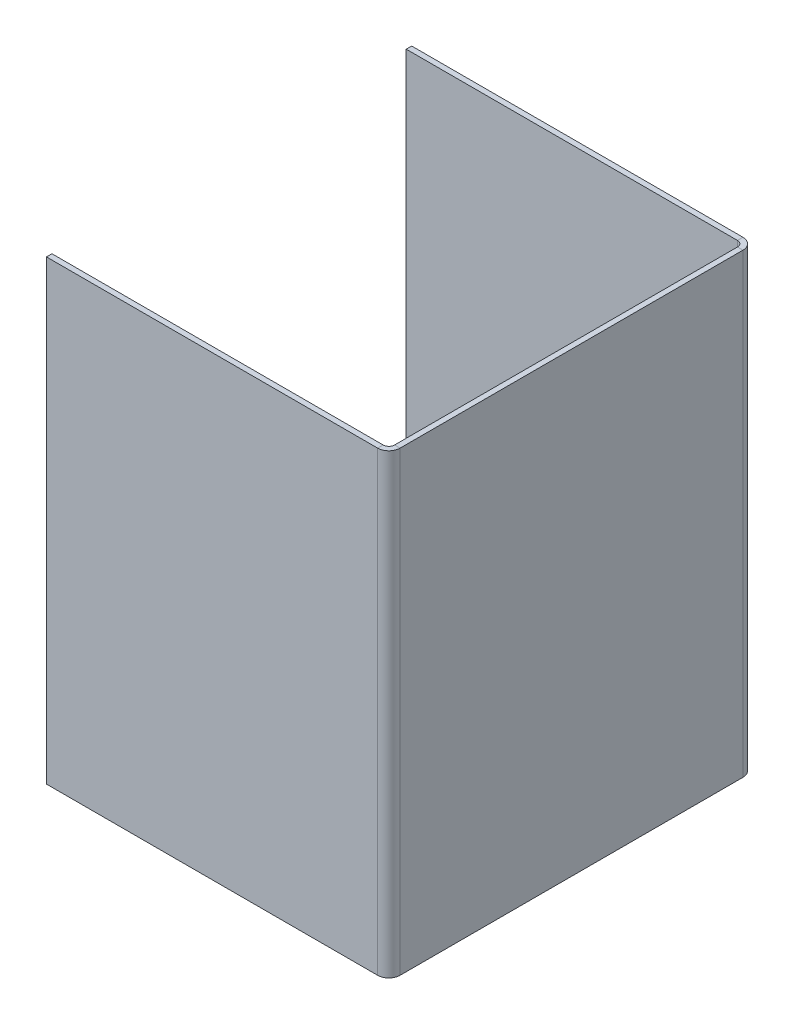
ISO-10303-21;
HEADER;
FILE_DESCRIPTION(('STEP AP214'),'2;1');
FILE_NAME('part.step','',(''),(''),'','','');
FILE_SCHEMA(('AUTOMOTIVE_DESIGN { 1 0 10303 214 1 1 1 1 }'));
ENDSEC;
DATA;
#1=APPLICATION_CONTEXT('core data for automotive mechanical design processes');
#2=APPLICATION_PROTOCOL_DEFINITION('international standard','automotive_design',2000,#1);
#3=PRODUCT_CONTEXT('',#1,'mechanical');
#4=PRODUCT('Part','Part','',(#3));
#5=PRODUCT_RELATED_PRODUCT_CATEGORY('part','',(#4));
#6=PRODUCT_DEFINITION_FORMATION('','',#4);
#7=PRODUCT_DEFINITION_CONTEXT('part definition',#1,'design');
#8=PRODUCT_DEFINITION('design','',#6,#7);
#9=PRODUCT_DEFINITION_SHAPE('','',#8);
#10=(LENGTH_UNIT() NAMED_UNIT(*) SI_UNIT(.MILLI.,.METRE.));
#11=(NAMED_UNIT(*) PLANE_ANGLE_UNIT() SI_UNIT($,.RADIAN.));
#12=(NAMED_UNIT(*) SI_UNIT($,.STERADIAN.) SOLID_ANGLE_UNIT());
#13=UNCERTAINTY_MEASURE_WITH_UNIT(LENGTH_MEASURE(1.E-05),#10,'distance_accuracy_value','');
#14=(GEOMETRIC_REPRESENTATION_CONTEXT(3) GLOBAL_UNCERTAINTY_ASSIGNED_CONTEXT((#13)) GLOBAL_UNIT_ASSIGNED_CONTEXT((#10,
#11,#12)) REPRESENTATION_CONTEXT('',''));
#15=CARTESIAN_POINT('',(0.,0.,0.));
#16=DIRECTION('',(0.,0.,1.));
#17=DIRECTION('',(1.,0.,0.));
#18=AXIS2_PLACEMENT_3D('',#15,#16,#17);
#19=CARTESIAN_POINT('',(-1.2192,0.,0.));
#20=DIRECTION('',(-1.,0.,0.));
#21=DIRECTION('',(0.,0.,1.));
#22=AXIS2_PLACEMENT_3D('',#19,#20,#21);
#23=PLANE('',#22);
#24=DIRECTION('',(0.,0.,1.));
#25=VECTOR('',#24,1.);
#26=CARTESIAN_POINT('',(-1.2192,101.6,0.));
#27=LINE('',#26,#25);
#28=CARTESIAN_POINT('',(-1.2192,101.6,-78.7908));
#29=VERTEX_POINT('',#28);
#30=CARTESIAN_POINT('',(-1.2192,101.6,-2.4892));
#31=VERTEX_POINT('',#30);
#32=EDGE_CURVE('E13',#29,#31,#27,.T.);
#33=ORIENTED_EDGE('',*,*,#32,.F.);
#34=DIRECTION('',(0.,-1.,0.));
#35=VECTOR('',#34,1.);
#36=CARTESIAN_POINT('',(-1.2192,0.,-78.7908));
#37=LINE('',#36,#35);
#38=CARTESIAN_POINT('',(-1.2192,0.,-78.7908));
#39=VERTEX_POINT('',#38);
#40=EDGE_CURVE('E224',#39,#29,#37,.F.);
#41=ORIENTED_EDGE('',*,*,#40,.F.);
#42=DIRECTION('',(0.,0.,-1.));
#43=VECTOR('',#42,1.);
#44=CARTESIAN_POINT('',(-1.2192,0.,0.));
#45=LINE('',#44,#43);
#46=CARTESIAN_POINT('',(-1.2192,0.,-2.4892));
#47=VERTEX_POINT('',#46);
#48=EDGE_CURVE('E87',#47,#39,#45,.T.);
#49=ORIENTED_EDGE('',*,*,#48,.F.);
#50=DIRECTION('',(0.,1.,0.));
#51=VECTOR('',#50,1.);
#52=CARTESIAN_POINT('',(-1.2192,101.6,-2.4892));
#53=LINE('',#52,#51);
#54=EDGE_CURVE('E280',#31,#47,#53,.F.);
#55=ORIENTED_EDGE('',*,*,#54,.F.);
#56=EDGE_LOOP('',(#33,#41,#49,#55));
#57=FACE_BOUND('',#56,.T.);
#58=ADVANCED_FACE('F78',(#57),#23,.T.);
#59=CARTESIAN_POINT('',(0.,0.,0.));
#60=DIRECTION('',(-1.,0.,0.));
#61=DIRECTION('',(0.,0.,1.));
#62=AXIS2_PLACEMENT_3D('',#59,#60,#61);
#63=PLANE('',#62);
#64=DIRECTION('',(0.,-1.,0.));
#65=VECTOR('',#64,1.);
#66=CARTESIAN_POINT('',(0.,0.,-78.7908));
#67=LINE('',#66,#65);
#68=CARTESIAN_POINT('',(0.,0.,-78.7908));
#69=VERTEX_POINT('',#68);
#70=CARTESIAN_POINT('',(0.,101.6,-78.7908));
#71=VERTEX_POINT('',#70);
#72=EDGE_CURVE('E212',#69,#71,#67,.F.);
#73=ORIENTED_EDGE('',*,*,#72,.T.);
#74=DIRECTION('',(0.,0.,1.));
#75=VECTOR('',#74,1.);
#76=CARTESIAN_POINT('',(0.,101.6,0.));
#77=LINE('',#76,#75);
#78=CARTESIAN_POINT('',(0.,101.6,-2.4892));
#79=VERTEX_POINT('',#78);
#80=EDGE_CURVE('E82',#71,#79,#77,.T.);
#81=ORIENTED_EDGE('',*,*,#80,.T.);
#82=DIRECTION('',(0.,1.,0.));
#83=VECTOR('',#82,1.);
#84=CARTESIAN_POINT('',(0.,101.6,-2.4892));
#85=LINE('',#84,#83);
#86=CARTESIAN_POINT('',(0.,0.,-2.4892));
#87=VERTEX_POINT('',#86);
#88=EDGE_CURVE('E268',#79,#87,#85,.F.);
#89=ORIENTED_EDGE('',*,*,#88,.T.);
#90=DIRECTION('',(0.,0.,-1.));
#91=VECTOR('',#90,1.);
#92=CARTESIAN_POINT('',(0.,0.,0.));
#93=LINE('',#92,#91);
#94=EDGE_CURVE('E286',#87,#69,#93,.T.);
#95=ORIENTED_EDGE('',*,*,#94,.T.);
#96=EDGE_LOOP('',(#73,#81,#89,#95));
#97=FACE_BOUND('',#96,.T.);
#98=ADVANCED_FACE('F290',(#97),#63,.F.);
#99=CARTESIAN_POINT('',(-1.2192,0.,0.));
#100=DIRECTION('',(0.,-1.,0.));
#101=DIRECTION('',(0.,0.,-1.));
#102=AXIS2_PLACEMENT_3D('',#99,#100,#101);
#103=PLANE('',#102);
#104=ORIENTED_EDGE('',*,*,#48,.T.);
#105=DIRECTION('',(1.,0.,0.));
#106=VECTOR('',#105,1.);
#107=CARTESIAN_POINT('',(-1.2192,0.,-78.7908));
#108=LINE('',#107,#106);
#109=EDGE_CURVE('E218',#39,#69,#108,.T.);
#110=ORIENTED_EDGE('',*,*,#109,.T.);
#111=ORIENTED_EDGE('',*,*,#94,.F.);
#112=DIRECTION('',(1.,0.,0.));
#113=VECTOR('',#112,1.);
#114=CARTESIAN_POINT('',(-1.2192,0.,-2.4892));
#115=LINE('',#114,#113);
#116=EDGE_CURVE('E95',#47,#87,#115,.T.);
#117=ORIENTED_EDGE('',*,*,#116,.F.);
#118=EDGE_LOOP('',(#104,#110,#111,#117));
#119=FACE_BOUND('',#118,.T.);
#120=ADVANCED_FACE('F80',(#119),#103,.T.);
#121=CARTESIAN_POINT('',(-1.2192,101.6,0.));
#122=DIRECTION('',(0.,1.,0.));
#123=DIRECTION('',(0.,0.,1.));
#124=AXIS2_PLACEMENT_3D('',#121,#122,#123);
#125=PLANE('',#124);
#126=DIRECTION('',(1.,0.,0.));
#127=VECTOR('',#126,1.);
#128=CARTESIAN_POINT('',(-1.2192,101.6,-78.7908));
#129=LINE('',#128,#127);
#130=EDGE_CURVE('E230',#29,#71,#129,.T.);
#131=ORIENTED_EDGE('',*,*,#130,.F.);
#132=ORIENTED_EDGE('',*,*,#32,.T.);
#133=DIRECTION('',(1.,0.,0.));
#134=VECTOR('',#133,1.);
#135=CARTESIAN_POINT('',(-1.2192,101.6,-2.4892));
#136=LINE('',#135,#134);
#137=EDGE_CURVE('E274',#31,#79,#136,.T.);
#138=ORIENTED_EDGE('',*,*,#137,.T.);
#139=ORIENTED_EDGE('',*,*,#80,.F.);
#140=EDGE_LOOP('',(#131,#132,#138,#139));
#141=FACE_BOUND('',#140,.T.);
#142=ADVANCED_FACE('F294',(#141),#125,.T.);
#143=CARTESIAN_POINT('',(-2.4892,0.,-2.4892));
#144=DIRECTION('',(0.,-1.,0.));
#145=DIRECTION('',(0.,0.,-1.));
#146=AXIS2_PLACEMENT_3D('',#143,#144,#145);
#147=PLANE('',#146);
#148=DIRECTION('',(0.,0.,1.));
#149=VECTOR('',#148,1.);
#150=CARTESIAN_POINT('',(-2.4892,0.,2.61726404438001E-13));
#151=LINE('',#150,#149);
#152=CARTESIAN_POINT('',(-2.48919999999999,0.,-1.2192));
#153=VERTEX_POINT('',#152);
#154=CARTESIAN_POINT('',(-2.48919999999999,0.,0.));
#155=VERTEX_POINT('',#154);
#156=EDGE_CURVE('E233',#153,#155,#151,.T.);
#157=ORIENTED_EDGE('',*,*,#156,.F.);
#158=CARTESIAN_POINT('',(-2.4892,0.,-2.4892));
#159=DIRECTION('',(0.,1.,0.));
#160=DIRECTION('',(0.,0.,1.));
#161=AXIS2_PLACEMENT_3D('',#158,#159,#160);
#162=CIRCLE('',#161,1.27);
#163=EDGE_CURVE('E277',#47,#153,#162,.F.);
#164=ORIENTED_EDGE('',*,*,#163,.F.);
#165=ORIENTED_EDGE('',*,*,#116,.T.);
#166=CARTESIAN_POINT('',(-2.4892,0.,-2.4892));
#167=DIRECTION('',(0.,1.,0.));
#168=DIRECTION('',(0.,0.,1.));
#169=AXIS2_PLACEMENT_3D('',#166,#167,#168);
#170=CIRCLE('',#169,2.4892);
#171=EDGE_CURVE('E270',#87,#155,#170,.F.);
#172=ORIENTED_EDGE('',*,*,#171,.T.);
#173=EDGE_LOOP('',(#157,#164,#165,#172));
#174=FACE_BOUND('',#173,.T.);
#175=ADVANCED_FACE('F319',(#174),#147,.T.);
#176=CARTESIAN_POINT('',(-2.4892,101.6,-2.4892));
#177=DIRECTION('',(0.,-1.,0.));
#178=DIRECTION('',(0.,0.,-1.));
#179=AXIS2_PLACEMENT_3D('',#176,#177,#178);
#180=PLANE('',#179);
#181=CARTESIAN_POINT('',(-2.4892,101.6,-2.4892));
#182=DIRECTION('',(0.,1.,0.));
#183=DIRECTION('',(0.,0.,1.));
#184=AXIS2_PLACEMENT_3D('',#181,#182,#183);
#185=CIRCLE('',#184,1.27);
#186=CARTESIAN_POINT('',(-2.48919999999999,101.6,-1.2192));
#187=VERTEX_POINT('',#186);
#188=EDGE_CURVE('E238',#187,#31,#185,.T.);
#189=ORIENTED_EDGE('',*,*,#188,.F.);
#190=DIRECTION('',(0.,0.,1.));
#191=VECTOR('',#190,1.);
#192=CARTESIAN_POINT('',(-2.4892,101.6,-1.2192));
#193=LINE('',#192,#191);
#194=CARTESIAN_POINT('',(-2.4892,101.6,0.));
#195=VERTEX_POINT('',#194);
#196=EDGE_CURVE('E261',#187,#195,#193,.T.);
#197=ORIENTED_EDGE('',*,*,#196,.T.);
#198=CARTESIAN_POINT('',(-2.4892,101.6,-2.4892));
#199=DIRECTION('',(0.,1.,0.));
#200=DIRECTION('',(0.,0.,1.));
#201=AXIS2_PLACEMENT_3D('',#198,#199,#200);
#202=CIRCLE('',#201,2.4892);
#203=EDGE_CURVE('E271',#195,#79,#202,.T.);
#204=ORIENTED_EDGE('',*,*,#203,.T.);
#205=ORIENTED_EDGE('',*,*,#137,.F.);
#206=EDGE_LOOP('',(#189,#197,#204,#205));
#207=FACE_BOUND('',#206,.T.);
#208=ADVANCED_FACE('F300',(#207),#180,.F.);
#209=CARTESIAN_POINT('',(-2.4892,101.6,-2.4892));
#210=DIRECTION('',(0.,1.,0.));
#211=DIRECTION('',(0.,0.,1.));
#212=AXIS2_PLACEMENT_3D('',#209,#210,#211);
#213=CYLINDRICAL_SURFACE('',#212,2.4892);
#214=ORIENTED_EDGE('',*,*,#88,.F.);
#215=ORIENTED_EDGE('',*,*,#203,.F.);
#216=DIRECTION('',(0.,1.,0.));
#217=VECTOR('',#216,1.);
#218=CARTESIAN_POINT('',(-2.4892,0.,0.));
#219=LINE('',#218,#217);
#220=EDGE_CURVE('E258',#155,#195,#219,.T.);
#221=ORIENTED_EDGE('',*,*,#220,.F.);
#222=ORIENTED_EDGE('',*,*,#171,.F.);
#223=EDGE_LOOP('',(#214,#215,#221,#222));
#224=FACE_BOUND('',#223,.T.);
#225=ADVANCED_FACE('F299',(#224),#213,.T.);
#226=CARTESIAN_POINT('',(-2.4892,101.6,-2.4892));
#227=DIRECTION('',(0.,1.,0.));
#228=DIRECTION('',(0.,0.,1.));
#229=AXIS2_PLACEMENT_3D('',#226,#227,#228);
#230=CYLINDRICAL_SURFACE('',#229,1.27);
#231=ORIENTED_EDGE('',*,*,#54,.T.);
#232=ORIENTED_EDGE('',*,*,#163,.T.);
#233=DIRECTION('',(0.,-1.,0.));
#234=VECTOR('',#233,1.);
#235=CARTESIAN_POINT('',(-2.4892,0.,-1.2192));
#236=LINE('',#235,#234);
#237=EDGE_CURVE('E264',#153,#187,#236,.F.);
#238=ORIENTED_EDGE('',*,*,#237,.T.);
#239=ORIENTED_EDGE('',*,*,#188,.T.);
#240=EDGE_LOOP('',(#231,#232,#238,#239));
#241=FACE_BOUND('',#240,.T.);
#242=ADVANCED_FACE('F322',(#241),#230,.F.);
#243=CARTESIAN_POINT('',(-1.2192,101.6,0.));
#244=DIRECTION('',(0.,1.,0.));
#245=DIRECTION('',(0.,0.,1.));
#246=AXIS2_PLACEMENT_3D('',#243,#244,#245);
#247=PLANE('',#246);
#248=DIRECTION('',(1.,0.,0.));
#249=VECTOR('',#248,1.);
#250=CARTESIAN_POINT('',(-1.2192,101.6,0.));
#251=LINE('',#250,#249);
#252=CARTESIAN_POINT('',(-76.2,101.6,2.61714069329905E-13));
#253=VERTEX_POINT('',#252);
#254=EDGE_CURVE('E242',#253,#195,#251,.T.);
#255=ORIENTED_EDGE('',*,*,#254,.T.);
#256=ORIENTED_EDGE('',*,*,#196,.F.);
#257=DIRECTION('',(-1.,0.,0.));
#258=VECTOR('',#257,1.);
#259=CARTESIAN_POINT('',(0.,101.6,-1.2192));
#260=LINE('',#259,#258);
#261=CARTESIAN_POINT('',(-76.2,101.6,-1.21919999999974));
#262=VERTEX_POINT('',#261);
#263=EDGE_CURVE('E250',#262,#187,#260,.F.);
#264=ORIENTED_EDGE('',*,*,#263,.F.);
#265=DIRECTION('',(0.,0.,-1.));
#266=VECTOR('',#265,1.);
#267=CARTESIAN_POINT('',(-76.2,101.6,2.61726404438001E-13));
#268=LINE('',#267,#266);
#269=EDGE_CURVE('E236',#253,#262,#268,.T.);
#270=ORIENTED_EDGE('',*,*,#269,.F.);
#271=EDGE_LOOP('',(#255,#256,#264,#270));
#272=FACE_BOUND('',#271,.T.);
#273=ADVANCED_FACE('F309',(#272),#247,.T.);
#274=CARTESIAN_POINT('',(-76.2,0.,2.61726404438001E-13));
#275=DIRECTION('',(0.,-1.,0.));
#276=DIRECTION('',(0.,0.,-1.));
#277=AXIS2_PLACEMENT_3D('',#274,#275,#276);
#278=PLANE('',#277);
#279=DIRECTION('',(1.,0.,0.));
#280=VECTOR('',#279,1.);
#281=CARTESIAN_POINT('',(0.,0.,-1.2192));
#282=LINE('',#281,#280);
#283=CARTESIAN_POINT('',(-76.2,0.,-1.21919999999974));
#284=VERTEX_POINT('',#283);
#285=EDGE_CURVE('E256',#153,#284,#282,.F.);
#286=ORIENTED_EDGE('',*,*,#285,.F.);
#287=ORIENTED_EDGE('',*,*,#156,.T.);
#288=DIRECTION('',(-1.,0.,0.));
#289=VECTOR('',#288,1.);
#290=CARTESIAN_POINT('',(-76.2,0.,2.61714069329905E-13));
#291=LINE('',#290,#289);
#292=CARTESIAN_POINT('',(-76.2,0.,2.61714069329905E-13));
#293=VERTEX_POINT('',#292);
#294=EDGE_CURVE('E248',#155,#293,#291,.T.);
#295=ORIENTED_EDGE('',*,*,#294,.T.);
#296=DIRECTION('',(0.,0.,-1.));
#297=VECTOR('',#296,1.);
#298=CARTESIAN_POINT('',(-76.2,0.,2.61726404438001E-13));
#299=LINE('',#298,#297);
#300=EDGE_CURVE('E239',#293,#284,#299,.T.);
#301=ORIENTED_EDGE('',*,*,#300,.T.);
#302=EDGE_LOOP('',(#286,#287,#295,#301));
#303=FACE_BOUND('',#302,.T.);
#304=ADVANCED_FACE('F316',(#303),#278,.T.);
#305=CARTESIAN_POINT('',(0.,0.,0.));
#306=DIRECTION('',(0.,0.,1.));
#307=DIRECTION('',(1.,0.,0.));
#308=AXIS2_PLACEMENT_3D('',#305,#306,#307);
#309=PLANE('',#308);
#310=ORIENTED_EDGE('',*,*,#294,.F.);
#311=ORIENTED_EDGE('',*,*,#220,.T.);
#312=ORIENTED_EDGE('',*,*,#254,.F.);
#313=DIRECTION('',(0.,1.,0.));
#314=VECTOR('',#313,1.);
#315=CARTESIAN_POINT('',(-76.2,101.6,2.61714069329905E-13));
#316=LINE('',#315,#314);
#317=EDGE_CURVE('E245',#293,#253,#316,.T.);
#318=ORIENTED_EDGE('',*,*,#317,.F.);
#319=EDGE_LOOP('',(#310,#311,#312,#318));
#320=FACE_BOUND('',#319,.T.);
#321=ADVANCED_FACE('F307',(#320),#309,.T.);
#322=CARTESIAN_POINT('',(0.,0.,-1.2192));
#323=DIRECTION('',(0.,0.,1.));
#324=DIRECTION('',(1.,0.,0.));
#325=AXIS2_PLACEMENT_3D('',#322,#323,#324);
#326=PLANE('',#325);
#327=ORIENTED_EDGE('',*,*,#237,.F.);
#328=ORIENTED_EDGE('',*,*,#285,.T.);
#329=DIRECTION('',(0.,-1.,0.));
#330=VECTOR('',#329,1.);
#331=CARTESIAN_POINT('',(-76.2,0.,-1.21919999999974));
#332=LINE('',#331,#330);
#333=EDGE_CURVE('E253',#284,#262,#332,.F.);
#334=ORIENTED_EDGE('',*,*,#333,.T.);
#335=ORIENTED_EDGE('',*,*,#263,.T.);
#336=EDGE_LOOP('',(#327,#328,#334,#335));
#337=FACE_BOUND('',#336,.T.);
#338=ADVANCED_FACE('F324',(#337),#326,.F.);
#339=CARTESIAN_POINT('',(-76.2,101.6,2.61726404438001E-13));
#340=DIRECTION('',(-1.,0.,0.));
#341=DIRECTION('',(0.,0.,1.));
#342=AXIS2_PLACEMENT_3D('',#339,#340,#341);
#343=PLANE('',#342);
#344=ORIENTED_EDGE('',*,*,#333,.F.);
#345=ORIENTED_EDGE('',*,*,#300,.F.);
#346=ORIENTED_EDGE('',*,*,#317,.T.);
#347=ORIENTED_EDGE('',*,*,#269,.T.);
#348=EDGE_LOOP('',(#344,#345,#346,#347));
#349=FACE_BOUND('',#348,.T.);
#350=ADVANCED_FACE('F313',(#349),#343,.T.);
#351=CARTESIAN_POINT('',(-2.4892,101.6,-78.7908));
#352=DIRECTION('',(0.,1.,0.));
#353=DIRECTION('',(0.,0.,1.));
#354=AXIS2_PLACEMENT_3D('',#351,#352,#353);
#355=PLANE('',#354);
#356=DIRECTION('',(0.,0.,1.));
#357=VECTOR('',#356,1.);
#358=CARTESIAN_POINT('',(-2.4892,101.6,-81.28));
#359=LINE('',#358,#357);
#360=CARTESIAN_POINT('',(-2.48919999999999,101.6,-80.0608));
#361=VERTEX_POINT('',#360);
#362=CARTESIAN_POINT('',(-2.48919999999999,101.6,-81.28));
#363=VERTEX_POINT('',#362);
#364=EDGE_CURVE('E194',#361,#363,#359,.F.);
#365=ORIENTED_EDGE('',*,*,#364,.F.);
#366=CARTESIAN_POINT('',(-2.4892,101.6,-78.7908));
#367=DIRECTION('',(0.,-1.,0.));
#368=DIRECTION('',(0.,0.,-1.));
#369=AXIS2_PLACEMENT_3D('',#366,#367,#368);
#370=CIRCLE('',#369,1.26999999999999);
#371=EDGE_CURVE('E221',#29,#361,#370,.F.);
#372=ORIENTED_EDGE('',*,*,#371,.F.);
#373=ORIENTED_EDGE('',*,*,#130,.T.);
#374=CARTESIAN_POINT('',(-2.4892,101.6,-78.7908));
#375=DIRECTION('',(0.,-1.,0.));
#376=DIRECTION('',(0.,0.,-1.));
#377=AXIS2_PLACEMENT_3D('',#374,#375,#376);
#378=CIRCLE('',#377,2.48919999999999);
#379=EDGE_CURVE('E214',#71,#363,#378,.F.);
#380=ORIENTED_EDGE('',*,*,#379,.T.);
#381=EDGE_LOOP('',(#365,#372,#373,#380));
#382=FACE_BOUND('',#381,.T.);
#383=ADVANCED_FACE('F331',(#382),#355,.T.);
#384=CARTESIAN_POINT('',(-2.4892,0.,-78.7908));
#385=DIRECTION('',(0.,1.,0.));
#386=DIRECTION('',(0.,0.,1.));
#387=AXIS2_PLACEMENT_3D('',#384,#385,#386);
#388=PLANE('',#387);
#389=CARTESIAN_POINT('',(-2.4892,0.,-78.7908));
#390=DIRECTION('',(0.,-1.,0.));
#391=DIRECTION('',(0.,0.,-1.));
#392=AXIS2_PLACEMENT_3D('',#389,#390,#391);
#393=CIRCLE('',#392,1.26999999999999);
#394=CARTESIAN_POINT('',(-2.48919999999999,0.,-80.0608));
#395=VERTEX_POINT('',#394);
#396=EDGE_CURVE('E227',#395,#39,#393,.T.);
#397=ORIENTED_EDGE('',*,*,#396,.F.);
#398=DIRECTION('',(0.,0.,1.));
#399=VECTOR('',#398,1.);
#400=CARTESIAN_POINT('',(-2.4892,0.,-80.0608));
#401=LINE('',#400,#399);
#402=CARTESIAN_POINT('',(-2.4892,0.,-81.28));
#403=VERTEX_POINT('',#402);
#404=EDGE_CURVE('E206',#395,#403,#401,.F.);
#405=ORIENTED_EDGE('',*,*,#404,.T.);
#406=CARTESIAN_POINT('',(-2.4892,0.,-78.7908));
#407=DIRECTION('',(0.,-1.,0.));
#408=DIRECTION('',(0.,0.,-1.));
#409=AXIS2_PLACEMENT_3D('',#406,#407,#408);
#410=CIRCLE('',#409,2.48919999999999);
#411=EDGE_CURVE('E215',#403,#69,#410,.T.);
#412=ORIENTED_EDGE('',*,*,#411,.T.);
#413=ORIENTED_EDGE('',*,*,#109,.F.);
#414=EDGE_LOOP('',(#397,#405,#412,#413));
#415=FACE_BOUND('',#414,.T.);
#416=ADVANCED_FACE('F354',(#415),#388,.F.);
#417=CARTESIAN_POINT('',(-2.4892,0.,-78.7908));
#418=DIRECTION('',(0.,-1.,0.));
#419=DIRECTION('',(0.,0.,-1.));
#420=AXIS2_PLACEMENT_3D('',#417,#418,#419);
#421=CYLINDRICAL_SURFACE('',#420,2.48919999999999);
#422=ORIENTED_EDGE('',*,*,#72,.F.);
#423=ORIENTED_EDGE('',*,*,#411,.F.);
#424=DIRECTION('',(0.,-1.,0.));
#425=VECTOR('',#424,1.);
#426=CARTESIAN_POINT('',(-2.4892,101.6,-81.28));
#427=LINE('',#426,#425);
#428=EDGE_CURVE('E204',#403,#363,#427,.F.);
#429=ORIENTED_EDGE('',*,*,#428,.T.);
#430=ORIENTED_EDGE('',*,*,#379,.F.);
#431=EDGE_LOOP('',(#422,#423,#429,#430));
#432=FACE_BOUND('',#431,.T.);
#433=ADVANCED_FACE('F367',(#432),#421,.T.);
#434=CARTESIAN_POINT('',(-2.4892,0.,-78.7908));
#435=DIRECTION('',(0.,-1.,0.));
#436=DIRECTION('',(0.,0.,-1.));
#437=AXIS2_PLACEMENT_3D('',#434,#435,#436);
#438=CYLINDRICAL_SURFACE('',#437,1.26999999999999);
#439=ORIENTED_EDGE('',*,*,#40,.T.);
#440=ORIENTED_EDGE('',*,*,#371,.T.);
#441=DIRECTION('',(0.,-1.,0.));
#442=VECTOR('',#441,1.);
#443=CARTESIAN_POINT('',(-2.4892,101.6,-80.0608));
#444=LINE('',#443,#442);
#445=EDGE_CURVE('E209',#361,#395,#444,.T.);
#446=ORIENTED_EDGE('',*,*,#445,.T.);
#447=ORIENTED_EDGE('',*,*,#396,.T.);
#448=EDGE_LOOP('',(#439,#440,#446,#447));
#449=FACE_BOUND('',#448,.T.);
#450=ADVANCED_FACE('F357',(#449),#438,.F.);
#451=CARTESIAN_POINT('',(-76.2,0.,-81.2800000000003));
#452=DIRECTION('',(0.,1.,0.));
#453=DIRECTION('',(0.,0.,1.));
#454=AXIS2_PLACEMENT_3D('',#451,#452,#453);
#455=PLANE('',#454);
#456=ORIENTED_EDGE('',*,*,#404,.F.);
#457=DIRECTION('',(1.,0.,0.));
#458=VECTOR('',#457,1.);
#459=CARTESIAN_POINT('',(-76.2,0.,-80.0608000000003));
#460=LINE('',#459,#458);
#461=CARTESIAN_POINT('',(-76.2,0.,-80.0608000000003));
#462=VERTEX_POINT('',#461);
#463=EDGE_CURVE('E202',#395,#462,#460,.F.);
#464=ORIENTED_EDGE('',*,*,#463,.T.);
#465=DIRECTION('',(0.,0.,1.));
#466=VECTOR('',#465,1.);
#467=CARTESIAN_POINT('',(-76.2,0.,-81.2800000000003));
#468=LINE('',#467,#466);
#469=CARTESIAN_POINT('',(-76.2,0.,-81.2800000000003));
#470=VERTEX_POINT('',#469);
#471=EDGE_CURVE('E190',#470,#462,#468,.T.);
#472=ORIENTED_EDGE('',*,*,#471,.F.);
#473=DIRECTION('',(-1.,0.,0.));
#474=VECTOR('',#473,1.);
#475=CARTESIAN_POINT('',(2.90086590035824E-13,0.,-81.28));
#476=LINE('',#475,#474);
#477=EDGE_CURVE('E177',#403,#470,#476,.T.);
#478=ORIENTED_EDGE('',*,*,#477,.F.);
#479=EDGE_LOOP('',(#456,#464,#472,#478));
#480=FACE_BOUND('',#479,.T.);
#481=ADVANCED_FACE('F364',(#480),#455,.F.);
#482=CARTESIAN_POINT('',(-1.2192,101.6,-81.28));
#483=DIRECTION('',(0.,-1.,0.));
#484=DIRECTION('',(0.,0.,-1.));
#485=AXIS2_PLACEMENT_3D('',#482,#483,#484);
#486=PLANE('',#485);
#487=ORIENTED_EDGE('',*,*,#364,.T.);
#488=DIRECTION('',(1.,0.,0.));
#489=VECTOR('',#488,1.);
#490=CARTESIAN_POINT('',(2.90086590035824E-13,101.6,-81.28));
#491=LINE('',#490,#489);
#492=CARTESIAN_POINT('',(-76.2,101.6,-81.2800000000003));
#493=VERTEX_POINT('',#492);
#494=EDGE_CURVE('E175',#493,#363,#491,.T.);
#495=ORIENTED_EDGE('',*,*,#494,.F.);
#496=DIRECTION('',(0.,0.,1.));
#497=VECTOR('',#496,1.);
#498=CARTESIAN_POINT('',(-76.2,101.6,-81.2800000000003));
#499=LINE('',#498,#497);
#500=CARTESIAN_POINT('',(-76.2,101.6,-80.0608000000003));
#501=VERTEX_POINT('',#500);
#502=EDGE_CURVE('E183',#493,#501,#499,.T.);
#503=ORIENTED_EDGE('',*,*,#502,.T.);
#504=DIRECTION('',(-1.,0.,0.));
#505=VECTOR('',#504,1.);
#506=CARTESIAN_POINT('',(-1.2192,101.6,-80.0608));
#507=LINE('',#506,#505);
#508=EDGE_CURVE('E199',#501,#361,#507,.F.);
#509=ORIENTED_EDGE('',*,*,#508,.T.);
#510=EDGE_LOOP('',(#487,#495,#503,#509));
#511=FACE_BOUND('',#510,.T.);
#512=ADVANCED_FACE('F193',(#511),#486,.F.);
#513=CARTESIAN_POINT('',(2.90086590035824E-13,0.,-81.28));
#514=DIRECTION('',(0.,0.,1.));
#515=DIRECTION('',(1.,0.,0.));
#516=AXIS2_PLACEMENT_3D('',#513,#514,#515);
#517=PLANE('',#516);
#518=ORIENTED_EDGE('',*,*,#428,.F.);
#519=ORIENTED_EDGE('',*,*,#477,.T.);
#520=DIRECTION('',(0.,1.,0.));
#521=VECTOR('',#520,1.);
#522=CARTESIAN_POINT('',(-76.2,0.,-81.2800000000003));
#523=LINE('',#522,#521);
#524=EDGE_CURVE('E170',#470,#493,#523,.T.);
#525=ORIENTED_EDGE('',*,*,#524,.T.);
#526=ORIENTED_EDGE('',*,*,#494,.T.);
#527=EDGE_LOOP('',(#518,#519,#525,#526));
#528=FACE_BOUND('',#527,.T.);
#529=ADVANCED_FACE('F173',(#528),#517,.F.);
#530=CARTESIAN_POINT('',(2.85829775987506E-13,0.,-80.0608));
#531=DIRECTION('',(0.,0.,1.));
#532=DIRECTION('',(1.,0.,0.));
#533=AXIS2_PLACEMENT_3D('',#530,#531,#532);
#534=PLANE('',#533);
#535=ORIENTED_EDGE('',*,*,#463,.F.);
#536=ORIENTED_EDGE('',*,*,#445,.F.);
#537=ORIENTED_EDGE('',*,*,#508,.F.);
#538=DIRECTION('',(0.,-1.,0.));
#539=VECTOR('',#538,1.);
#540=CARTESIAN_POINT('',(-76.2,101.6,-80.0608000000003));
#541=LINE('',#540,#539);
#542=EDGE_CURVE('E186',#462,#501,#541,.F.);
#543=ORIENTED_EDGE('',*,*,#542,.F.);
#544=EDGE_LOOP('',(#535,#536,#537,#543));
#545=FACE_BOUND('',#544,.T.);
#546=ADVANCED_FACE('F362',(#545),#534,.T.);
#547=CARTESIAN_POINT('',(-76.2,101.6,-81.2800000000003));
#548=DIRECTION('',(1.,0.,0.));
#549=DIRECTION('',(0.,0.,-1.));
#550=AXIS2_PLACEMENT_3D('',#547,#548,#549);
#551=PLANE('',#550);
#552=ORIENTED_EDGE('',*,*,#542,.T.);
#553=ORIENTED_EDGE('',*,*,#502,.F.);
#554=ORIENTED_EDGE('',*,*,#524,.F.);
#555=ORIENTED_EDGE('',*,*,#471,.T.);
#556=EDGE_LOOP('',(#552,#553,#554,#555));
#557=FACE_BOUND('',#556,.T.);
#558=ADVANCED_FACE('F184',(#557),#551,.F.);
#559=CLOSED_SHELL('',(#58,#98,#120,#142,#175,#208,#225,#242,#273,#304,#321,#338,#350,#383,#416,
#433,#450,#481,#512,#529,#546,#558));
#560=MANIFOLD_SOLID_BREP('B2',#559);
#561=ADVANCED_BREP_SHAPE_REPRESENTATION('',(#18,#560),#14);
#562=SHAPE_DEFINITION_REPRESENTATION(#9,#561);
ENDSEC;
END-ISO-10303-21;
